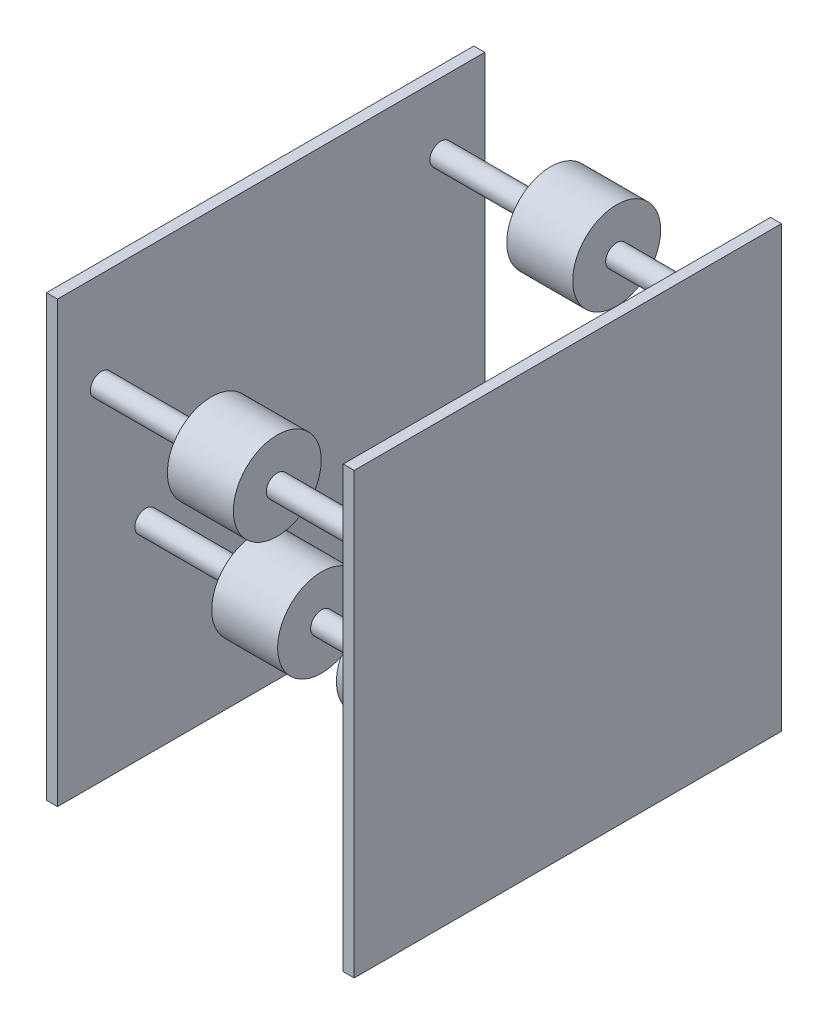
ISO-10303-21;
HEADER;
FILE_DESCRIPTION(('STEP AP214'),'2;1');
FILE_NAME('part.step','',(''),(''),'','','');
FILE_SCHEMA(('AUTOMOTIVE_DESIGN { 1 0 10303 214 1 1 1 1 }'));
ENDSEC;
DATA;
#1=APPLICATION_CONTEXT('core data for automotive mechanical design processes');
#2=APPLICATION_PROTOCOL_DEFINITION('international standard','automotive_design',2000,#1);
#3=PRODUCT_CONTEXT('',#1,'mechanical');
#4=PRODUCT('Part','Part','',(#3));
#5=PRODUCT_RELATED_PRODUCT_CATEGORY('part','',(#4));
#6=PRODUCT_DEFINITION_FORMATION('','',#4);
#7=PRODUCT_DEFINITION_CONTEXT('part definition',#1,'design');
#8=PRODUCT_DEFINITION('design','',#6,#7);
#9=PRODUCT_DEFINITION_SHAPE('','',#8);
#10=(LENGTH_UNIT() NAMED_UNIT(*) SI_UNIT(.MILLI.,.METRE.));
#11=(NAMED_UNIT(*) PLANE_ANGLE_UNIT() SI_UNIT($,.RADIAN.));
#12=(NAMED_UNIT(*) SI_UNIT($,.STERADIAN.) SOLID_ANGLE_UNIT());
#13=UNCERTAINTY_MEASURE_WITH_UNIT(LENGTH_MEASURE(1.E-05),#10,'distance_accuracy_value','');
#14=(GEOMETRIC_REPRESENTATION_CONTEXT(3) GLOBAL_UNCERTAINTY_ASSIGNED_CONTEXT((#13)) GLOBAL_UNIT_ASSIGNED_CONTEXT((#10,
#11,#12)) REPRESENTATION_CONTEXT('',''));
#15=CARTESIAN_POINT('',(0.,0.,0.));
#16=DIRECTION('',(0.,0.,1.));
#17=DIRECTION('',(1.,0.,0.));
#18=AXIS2_PLACEMENT_3D('',#15,#16,#17);
#19=CARTESIAN_POINT('',(100.510512242138,215.9,-221.50092631936));
#20=DIRECTION('',(-1.,0.,0.));
#21=DIRECTION('',(0.,0.,1.));
#22=AXIS2_PLACEMENT_3D('',#19,#20,#21);
#23=CYLINDRICAL_SURFACE('',#22,6.34999999999997);
#24=CARTESIAN_POINT('',(-82.55,215.9,-221.50092631936));
#25=DIRECTION('',(-1.,0.,0.));
#26=DIRECTION('',(0.,0.,1.));
#27=AXIS2_PLACEMENT_3D('',#24,#25,#26);
#28=CIRCLE('',#27,6.34999999999997);
#29=CARTESIAN_POINT('',(-82.55,215.9,-215.15092631936));
#30=VERTEX_POINT('',#29);
#31=EDGE_CURVE('E258',#30,#30,#28,.F.);
#32=ORIENTED_EDGE('',*,*,#31,.T.);
#33=EDGE_LOOP('',(#32));
#34=FACE_BOUND('',#33,.T.);
#35=CARTESIAN_POINT('',(-19.05,215.9,-221.50092631936));
#36=DIRECTION('',(1.,0.,0.));
#37=DIRECTION('',(0.,0.,-1.));
#38=AXIS2_PLACEMENT_3D('',#35,#36,#37);
#39=CIRCLE('',#38,6.34999999999997);
#40=CARTESIAN_POINT('',(-19.05,215.9,-227.85092631936));
#41=VERTEX_POINT('',#40);
#42=EDGE_CURVE('E11',#41,#41,#39,.T.);
#43=ORIENTED_EDGE('',*,*,#42,.F.);
#44=EDGE_LOOP('',(#43));
#45=FACE_BOUND('',#44,.T.);
#46=ADVANCED_FACE('F51',(#34,#45),#23,.T.);
#47=CARTESIAN_POINT('',(100.510512242138,198.743392040124,-25.4));
#48=DIRECTION('',(-1.,0.,0.));
#49=DIRECTION('',(0.,0.,1.));
#50=AXIS2_PLACEMENT_3D('',#47,#48,#49);
#51=CYLINDRICAL_SURFACE('',#50,6.35);
#52=CARTESIAN_POINT('',(-82.55,198.743392040124,-25.4));
#53=DIRECTION('',(-1.,0.,0.));
#54=DIRECTION('',(0.,0.,1.));
#55=AXIS2_PLACEMENT_3D('',#52,#53,#54);
#56=CIRCLE('',#55,6.35);
#57=CARTESIAN_POINT('',(-82.55,198.743392040124,-19.05));
#58=VERTEX_POINT('',#57);
#59=EDGE_CURVE('E240',#58,#58,#56,.F.);
#60=ORIENTED_EDGE('',*,*,#59,.T.);
#61=EDGE_LOOP('',(#60));
#62=FACE_BOUND('',#61,.T.);
#63=CARTESIAN_POINT('',(-19.05,198.743392040124,-25.4));
#64=DIRECTION('',(1.,0.,0.));
#65=DIRECTION('',(0.,0.,-1.));
#66=AXIS2_PLACEMENT_3D('',#63,#64,#65);
#67=CIRCLE('',#66,6.35);
#68=CARTESIAN_POINT('',(-19.05,198.743392040124,-31.75));
#69=VERTEX_POINT('',#68);
#70=EDGE_CURVE('E254',#69,#69,#67,.T.);
#71=ORIENTED_EDGE('',*,*,#70,.F.);
#72=EDGE_LOOP('',(#71));
#73=FACE_BOUND('',#72,.T.);
#74=ADVANCED_FACE('F310',(#62,#73),#51,.T.);
#75=CARTESIAN_POINT('',(100.510512242138,117.475000000001,-51.0238255843932));
#76=DIRECTION('',(-1.,0.,0.));
#77=DIRECTION('',(0.,0.,1.));
#78=AXIS2_PLACEMENT_3D('',#75,#76,#77);
#79=CYLINDRICAL_SURFACE('',#78,6.34999999999999);
#80=CARTESIAN_POINT('',(-82.55,117.475000000001,-51.0238255843932));
#81=DIRECTION('',(-1.,0.,0.));
#82=DIRECTION('',(0.,0.,1.));
#83=AXIS2_PLACEMENT_3D('',#80,#81,#82);
#84=CIRCLE('',#83,6.34999999999999);
#85=CARTESIAN_POINT('',(-82.55,117.475000000001,-44.6738255843932));
#86=VERTEX_POINT('',#85);
#87=EDGE_CURVE('E222',#86,#86,#84,.F.);
#88=ORIENTED_EDGE('',*,*,#87,.T.);
#89=EDGE_LOOP('',(#88));
#90=FACE_BOUND('',#89,.T.);
#91=CARTESIAN_POINT('',(-19.05,117.475000000001,-51.0238255843932));
#92=DIRECTION('',(1.,0.,0.));
#93=DIRECTION('',(0.,0.,-1.));
#94=AXIS2_PLACEMENT_3D('',#91,#92,#93);
#95=CIRCLE('',#94,6.34999999999999);
#96=CARTESIAN_POINT('',(-19.05,117.475000000001,-57.3738255843931));
#97=VERTEX_POINT('',#96);
#98=EDGE_CURVE('E236',#97,#97,#95,.T.);
#99=ORIENTED_EDGE('',*,*,#98,.F.);
#100=EDGE_LOOP('',(#99));
#101=FACE_BOUND('',#100,.T.);
#102=ADVANCED_FACE('F300',(#90,#101),#79,.T.);
#103=CARTESIAN_POINT('',(100.510512242138,45.4228992650335,-123.07592631936));
#104=DIRECTION('',(-1.,0.,0.));
#105=DIRECTION('',(0.,0.,1.));
#106=AXIS2_PLACEMENT_3D('',#103,#104,#105);
#107=CYLINDRICAL_SURFACE('',#106,6.35);
#108=CARTESIAN_POINT('',(-82.55,45.4228992650335,-123.07592631936));
#109=DIRECTION('',(-1.,0.,0.));
#110=DIRECTION('',(0.,0.,1.));
#111=AXIS2_PLACEMENT_3D('',#108,#109,#110);
#112=CIRCLE('',#111,6.35);
#113=CARTESIAN_POINT('',(-82.55,45.4228992650335,-116.72592631936));
#114=VERTEX_POINT('',#113);
#115=EDGE_CURVE('E206',#114,#114,#112,.F.);
#116=ORIENTED_EDGE('',*,*,#115,.T.);
#117=EDGE_LOOP('',(#116));
#118=FACE_BOUND('',#117,.T.);
#119=CARTESIAN_POINT('',(-19.05,45.4228992650335,-123.07592631936));
#120=DIRECTION('',(1.,0.,0.));
#121=DIRECTION('',(0.,0.,-1.));
#122=AXIS2_PLACEMENT_3D('',#119,#120,#121);
#123=CIRCLE('',#122,6.35);
#124=CARTESIAN_POINT('',(-19.05,45.4228992650335,-129.42592631936));
#125=VERTEX_POINT('',#124);
#126=EDGE_CURVE('E218',#125,#125,#123,.T.);
#127=ORIENTED_EDGE('',*,*,#126,.F.);
#128=EDGE_LOOP('',(#127));
#129=FACE_BOUND('',#128,.T.);
#130=ADVANCED_FACE('F289',(#118,#129),#107,.T.);
#131=CARTESIAN_POINT('',(100.510512242138,19.0500000000001,-221.50092631936));
#132=DIRECTION('',(-1.,0.,0.));
#133=DIRECTION('',(0.,0.,1.));
#134=AXIS2_PLACEMENT_3D('',#131,#132,#133);
#135=CYLINDRICAL_SURFACE('',#134,6.35);
#136=CARTESIAN_POINT('',(19.05,19.0500000000001,-221.50092631936));
#137=DIRECTION('',(1.,0.,0.));
#138=DIRECTION('',(0.,0.,-1.));
#139=AXIS2_PLACEMENT_3D('',#136,#137,#138);
#140=CIRCLE('',#139,6.35);
#141=CARTESIAN_POINT('',(19.05,19.0500000000001,-227.85092631936));
#142=VERTEX_POINT('',#141);
#143=EDGE_CURVE('E133',#142,#142,#140,.T.);
#144=ORIENTED_EDGE('',*,*,#143,.T.);
#145=EDGE_LOOP('',(#144));
#146=FACE_BOUND('',#145,.T.);
#147=CARTESIAN_POINT('',(82.55,19.0500000000001,-221.50092631936));
#148=DIRECTION('',(1.,0.,0.));
#149=DIRECTION('',(0.,0.,-1.));
#150=AXIS2_PLACEMENT_3D('',#147,#148,#149);
#151=CIRCLE('',#150,6.35);
#152=CARTESIAN_POINT('',(82.55,19.0500000000001,-227.85092631936));
#153=VERTEX_POINT('',#152);
#154=EDGE_CURVE('E154',#153,#153,#151,.T.);
#155=ORIENTED_EDGE('',*,*,#154,.F.);
#156=EDGE_LOOP('',(#155));
#157=FACE_BOUND('',#156,.T.);
#158=ADVANCED_FACE('F286',(#146,#157),#135,.T.);
#159=CARTESIAN_POINT('',(88.9,0.,0.));
#160=DIRECTION('',(-1.,0.,0.));
#161=DIRECTION('',(0.,0.,1.));
#162=AXIS2_PLACEMENT_3D('',#159,#160,#161);
#163=PLANE('',#162);
#164=DIRECTION('',(0.,-1.,0.));
#165=VECTOR('',#164,1.);
#166=CARTESIAN_POINT('',(88.9,0.,0.));
#167=LINE('',#166,#165);
#168=CARTESIAN_POINT('',(88.9,254.,0.));
#169=VERTEX_POINT('',#168);
#170=CARTESIAN_POINT('',(88.9,0.,0.));
#171=VERTEX_POINT('',#170);
#172=EDGE_CURVE('E379',#169,#171,#167,.T.);
#173=ORIENTED_EDGE('',*,*,#172,.T.);
#174=DIRECTION('',(0.,0.,-1.));
#175=VECTOR('',#174,1.);
#176=CARTESIAN_POINT('',(88.9,0.,0.));
#177=LINE('',#176,#175);
#178=CARTESIAN_POINT('',(88.9,0.,-246.90092631936));
#179=VERTEX_POINT('',#178);
#180=EDGE_CURVE('E146',#171,#179,#177,.T.);
#181=ORIENTED_EDGE('',*,*,#180,.T.);
#182=DIRECTION('',(0.,1.,0.));
#183=VECTOR('',#182,1.);
#184=CARTESIAN_POINT('',(88.9,0.,-246.90092631936));
#185=LINE('',#184,#183);
#186=CARTESIAN_POINT('',(88.9,254.,-246.90092631936));
#187=VERTEX_POINT('',#186);
#188=EDGE_CURVE('E385',#179,#187,#185,.T.);
#189=ORIENTED_EDGE('',*,*,#188,.T.);
#190=DIRECTION('',(0.,0.,1.));
#191=VECTOR('',#190,1.);
#192=CARTESIAN_POINT('',(88.9,254.,0.));
#193=LINE('',#192,#191);
#194=EDGE_CURVE('E388',#187,#169,#193,.T.);
#195=ORIENTED_EDGE('',*,*,#194,.T.);
#196=EDGE_LOOP('',(#173,#181,#189,#195));
#197=FACE_BOUND('',#196,.T.);
#198=ADVANCED_FACE('F288',(#197),#163,.F.);
#199=CARTESIAN_POINT('',(88.9,254.,0.));
#200=DIRECTION('',(0.,-1.,0.));
#201=DIRECTION('',(0.,0.,-1.));
#202=AXIS2_PLACEMENT_3D('',#199,#200,#201);
#203=PLANE('',#202);
#204=DIRECTION('',(-1.,0.,0.));
#205=VECTOR('',#204,1.);
#206=CARTESIAN_POINT('',(88.9,254.,-246.90092631936));
#207=LINE('',#206,#205);
#208=CARTESIAN_POINT('',(82.55,254.,-246.90092631936));
#209=VERTEX_POINT('',#208);
#210=EDGE_CURVE('E156',#187,#209,#207,.T.);
#211=ORIENTED_EDGE('',*,*,#210,.T.);
#212=DIRECTION('',(0.,0.,1.));
#213=VECTOR('',#212,1.);
#214=CARTESIAN_POINT('',(82.55,254.,0.));
#215=LINE('',#214,#213);
#216=CARTESIAN_POINT('',(82.55,254.,0.));
#217=VERTEX_POINT('',#216);
#218=EDGE_CURVE('E149',#209,#217,#215,.T.);
#219=ORIENTED_EDGE('',*,*,#218,.T.);
#220=DIRECTION('',(-1.,0.,0.));
#221=VECTOR('',#220,1.);
#222=CARTESIAN_POINT('',(88.9,254.,0.));
#223=LINE('',#222,#221);
#224=EDGE_CURVE('E142',#169,#217,#223,.T.);
#225=ORIENTED_EDGE('',*,*,#224,.F.);
#226=ORIENTED_EDGE('',*,*,#194,.F.);
#227=EDGE_LOOP('',(#211,#219,#225,#226));
#228=FACE_BOUND('',#227,.T.);
#229=ADVANCED_FACE('F297',(#228),#203,.F.);
#230=CARTESIAN_POINT('',(88.9,0.,-246.90092631936));
#231=DIRECTION('',(0.,0.,1.));
#232=DIRECTION('',(1.,0.,0.));
#233=AXIS2_PLACEMENT_3D('',#230,#231,#232);
#234=PLANE('',#233);
#235=DIRECTION('',(-1.,0.,0.));
#236=VECTOR('',#235,1.);
#237=CARTESIAN_POINT('',(88.9,0.,-246.90092631936));
#238=LINE('',#237,#236);
#239=CARTESIAN_POINT('',(82.55,0.,-246.90092631936));
#240=VERTEX_POINT('',#239);
#241=EDGE_CURVE('E150',#179,#240,#238,.T.);
#242=ORIENTED_EDGE('',*,*,#241,.T.);
#243=DIRECTION('',(0.,1.,0.));
#244=VECTOR('',#243,1.);
#245=CARTESIAN_POINT('',(82.55,0.,-246.90092631936));
#246=LINE('',#245,#244);
#247=EDGE_CURVE('E127',#240,#209,#246,.T.);
#248=ORIENTED_EDGE('',*,*,#247,.T.);
#249=ORIENTED_EDGE('',*,*,#210,.F.);
#250=ORIENTED_EDGE('',*,*,#188,.F.);
#251=EDGE_LOOP('',(#242,#248,#249,#250));
#252=FACE_BOUND('',#251,.T.);
#253=ADVANCED_FACE('F399',(#252),#234,.F.);
#254=CARTESIAN_POINT('',(88.9,0.,0.));
#255=DIRECTION('',(0.,1.,0.));
#256=DIRECTION('',(0.,0.,1.));
#257=AXIS2_PLACEMENT_3D('',#254,#255,#256);
#258=PLANE('',#257);
#259=DIRECTION('',(-1.,0.,0.));
#260=VECTOR('',#259,1.);
#261=CARTESIAN_POINT('',(88.9,0.,0.));
#262=LINE('',#261,#260);
#263=CARTESIAN_POINT('',(82.55,0.,0.));
#264=VERTEX_POINT('',#263);
#265=EDGE_CURVE('E140',#171,#264,#262,.T.);
#266=ORIENTED_EDGE('',*,*,#265,.T.);
#267=DIRECTION('',(0.,0.,-1.));
#268=VECTOR('',#267,1.);
#269=CARTESIAN_POINT('',(82.55,0.,0.));
#270=LINE('',#269,#268);
#271=EDGE_CURVE('E121',#264,#240,#270,.T.);
#272=ORIENTED_EDGE('',*,*,#271,.T.);
#273=ORIENTED_EDGE('',*,*,#241,.F.);
#274=ORIENTED_EDGE('',*,*,#180,.F.);
#275=EDGE_LOOP('',(#266,#272,#273,#274));
#276=FACE_BOUND('',#275,.T.);
#277=ADVANCED_FACE('F145',(#276),#258,.F.);
#278=CARTESIAN_POINT('',(88.9,0.,0.));
#279=DIRECTION('',(0.,0.,-1.));
#280=DIRECTION('',(-1.,0.,0.));
#281=AXIS2_PLACEMENT_3D('',#278,#279,#280);
#282=PLANE('',#281);
#283=ORIENTED_EDGE('',*,*,#224,.T.);
#284=DIRECTION('',(0.,1.,0.));
#285=VECTOR('',#284,1.);
#286=CARTESIAN_POINT('',(82.55,0.,0.));
#287=LINE('',#286,#285);
#288=EDGE_CURVE('E124',#264,#217,#287,.T.);
#289=ORIENTED_EDGE('',*,*,#288,.F.);
#290=ORIENTED_EDGE('',*,*,#265,.F.);
#291=ORIENTED_EDGE('',*,*,#172,.F.);
#292=EDGE_LOOP('',(#283,#289,#290,#291));
#293=FACE_BOUND('',#292,.T.);
#294=ADVANCED_FACE('F138',(#293),#282,.F.);
#295=CARTESIAN_POINT('',(82.55,0.,0.));
#296=DIRECTION('',(1.,0.,0.));
#297=DIRECTION('',(0.,0.,-1.));
#298=AXIS2_PLACEMENT_3D('',#295,#296,#297);
#299=PLANE('',#298);
#300=CARTESIAN_POINT('',(82.55,215.9,-221.50092631936));
#301=DIRECTION('',(1.,0.,0.));
#302=DIRECTION('',(0.,0.,-1.));
#303=AXIS2_PLACEMENT_3D('',#300,#301,#302);
#304=CIRCLE('',#303,6.34999999999997);
#305=CARTESIAN_POINT('',(82.55,215.9,-227.85092631936));
#306=VERTEX_POINT('',#305);
#307=EDGE_CURVE('E62',#306,#306,#304,.F.);
#308=ORIENTED_EDGE('',*,*,#307,.F.);
#309=EDGE_LOOP('',(#308));
#310=FACE_BOUND('',#309,.T.);
#311=CARTESIAN_POINT('',(82.55,198.743392040124,-25.4));
#312=DIRECTION('',(1.,0.,0.));
#313=DIRECTION('',(0.,0.,-1.));
#314=AXIS2_PLACEMENT_3D('',#311,#312,#313);
#315=CIRCLE('',#314,6.35);
#316=CARTESIAN_POINT('',(82.55,198.743392040124,-31.75));
#317=VERTEX_POINT('',#316);
#318=EDGE_CURVE('E250',#317,#317,#315,.F.);
#319=ORIENTED_EDGE('',*,*,#318,.F.);
#320=EDGE_LOOP('',(#319));
#321=FACE_BOUND('',#320,.T.);
#322=CARTESIAN_POINT('',(82.55,117.475000000001,-51.0238255843932));
#323=DIRECTION('',(1.,0.,0.));
#324=DIRECTION('',(0.,0.,-1.));
#325=AXIS2_PLACEMENT_3D('',#322,#323,#324);
#326=CIRCLE('',#325,6.34999999999999);
#327=CARTESIAN_POINT('',(82.55,117.475000000001,-57.3738255843931));
#328=VERTEX_POINT('',#327);
#329=EDGE_CURVE('E232',#328,#328,#326,.F.);
#330=ORIENTED_EDGE('',*,*,#329,.F.);
#331=EDGE_LOOP('',(#330));
#332=FACE_BOUND('',#331,.T.);
#333=CARTESIAN_POINT('',(82.55,45.4228992650335,-123.07592631936));
#334=DIRECTION('',(1.,0.,0.));
#335=DIRECTION('',(0.,0.,-1.));
#336=AXIS2_PLACEMENT_3D('',#333,#334,#335);
#337=CIRCLE('',#336,6.35);
#338=CARTESIAN_POINT('',(82.55,45.4228992650335,-129.42592631936));
#339=VERTEX_POINT('',#338);
#340=EDGE_CURVE('E214',#339,#339,#337,.F.);
#341=ORIENTED_EDGE('',*,*,#340,.F.);
#342=EDGE_LOOP('',(#341));
#343=FACE_BOUND('',#342,.T.);
#344=ORIENTED_EDGE('',*,*,#154,.T.);
#345=EDGE_LOOP('',(#344));
#346=FACE_BOUND('',#345,.T.);
#347=ORIENTED_EDGE('',*,*,#247,.F.);
#348=ORIENTED_EDGE('',*,*,#271,.F.);
#349=ORIENTED_EDGE('',*,*,#288,.T.);
#350=ORIENTED_EDGE('',*,*,#218,.F.);
#351=EDGE_LOOP('',(#347,#348,#349,#350));
#352=FACE_BOUND('',#351,.T.);
#353=ADVANCED_FACE('F123',(#310,#321,#332,#343,#346,#352),#299,.F.);
#354=CARTESIAN_POINT('',(19.05,19.0500000000001,-221.50092631936));
#355=DIRECTION('',(-1.,0.,0.));
#356=DIRECTION('',(0.,0.,1.));
#357=AXIS2_PLACEMENT_3D('',#354,#355,#356);
#358=CYLINDRICAL_SURFACE('',#357,25.4000000000002);
#359=CARTESIAN_POINT('',(19.05,19.0500000000001,-221.50092631936));
#360=DIRECTION('',(1.,0.,0.));
#361=DIRECTION('',(0.,0.,-1.));
#362=AXIS2_PLACEMENT_3D('',#359,#360,#361);
#363=CIRCLE('',#362,25.4000000000002);
#364=CARTESIAN_POINT('',(19.05,19.0500000000001,-246.90092631936));
#365=VERTEX_POINT('',#364);
#366=EDGE_CURVE('E227',#365,#365,#363,.T.);
#367=ORIENTED_EDGE('',*,*,#366,.F.);
#368=EDGE_LOOP('',(#367));
#369=FACE_BOUND('',#368,.T.);
#370=CARTESIAN_POINT('',(-19.05,19.0500000000001,-221.50092631936));
#371=DIRECTION('',(1.,0.,0.));
#372=DIRECTION('',(0.,0.,-1.));
#373=AXIS2_PLACEMENT_3D('',#370,#371,#372);
#374=CIRCLE('',#373,25.4000000000002);
#375=CARTESIAN_POINT('',(-19.05,19.0500000000001,-246.90092631936));
#376=VERTEX_POINT('',#375);
#377=EDGE_CURVE('E210',#376,#376,#374,.T.);
#378=ORIENTED_EDGE('',*,*,#377,.T.);
#379=EDGE_LOOP('',(#378));
#380=FACE_BOUND('',#379,.T.);
#381=ADVANCED_FACE('F276',(#369,#380),#358,.T.);
#382=CARTESIAN_POINT('',(19.05,19.0500000000001,-221.50092631936));
#383=DIRECTION('',(1.,0.,0.));
#384=DIRECTION('',(0.,0.,-1.));
#385=AXIS2_PLACEMENT_3D('',#382,#383,#384);
#386=PLANE('',#385);
#387=ORIENTED_EDGE('',*,*,#143,.F.);
#388=EDGE_LOOP('',(#387));
#389=FACE_BOUND('',#388,.T.);
#390=ORIENTED_EDGE('',*,*,#366,.T.);
#391=EDGE_LOOP('',(#390));
#392=FACE_BOUND('',#391,.T.);
#393=ADVANCED_FACE('F425',(#389,#392),#386,.T.);
#394=CARTESIAN_POINT('',(-19.05,19.0500000000001,-221.50092631936));
#395=DIRECTION('',(1.,0.,0.));
#396=DIRECTION('',(0.,0.,-1.));
#397=AXIS2_PLACEMENT_3D('',#394,#395,#396);
#398=PLANE('',#397);
#399=CARTESIAN_POINT('',(-19.05,19.0500000000001,-221.50092631936));
#400=DIRECTION('',(1.,0.,0.));
#401=DIRECTION('',(0.,0.,-1.));
#402=AXIS2_PLACEMENT_3D('',#399,#400,#401);
#403=CIRCLE('',#402,6.35);
#404=CARTESIAN_POINT('',(-19.05,19.0500000000001,-227.85092631936));
#405=VERTEX_POINT('',#404);
#406=EDGE_CURVE('E202',#405,#405,#403,.T.);
#407=ORIENTED_EDGE('',*,*,#406,.T.);
#408=EDGE_LOOP('',(#407));
#409=FACE_BOUND('',#408,.T.);
#410=ORIENTED_EDGE('',*,*,#377,.F.);
#411=EDGE_LOOP('',(#410));
#412=FACE_BOUND('',#411,.T.);
#413=ADVANCED_FACE('F439',(#409,#412),#398,.F.);
#414=CARTESIAN_POINT('',(-88.9,0.,0.));
#415=DIRECTION('',(-1.,0.,0.));
#416=DIRECTION('',(0.,0.,1.));
#417=AXIS2_PLACEMENT_3D('',#414,#415,#416);
#418=PLANE('',#417);
#419=DIRECTION('',(0.,-1.,0.));
#420=VECTOR('',#419,1.);
#421=CARTESIAN_POINT('',(-88.9,0.,0.));
#422=LINE('',#421,#420);
#423=CARTESIAN_POINT('',(-88.9,254.,0.));
#424=VERTEX_POINT('',#423);
#425=CARTESIAN_POINT('',(-88.9,0.,0.));
#426=VERTEX_POINT('',#425);
#427=EDGE_CURVE('E178',#424,#426,#422,.T.);
#428=ORIENTED_EDGE('',*,*,#427,.F.);
#429=DIRECTION('',(0.,0.,1.));
#430=VECTOR('',#429,1.);
#431=CARTESIAN_POINT('',(-88.9,254.,0.));
#432=LINE('',#431,#430);
#433=CARTESIAN_POINT('',(-88.9,254.,-246.90092631936));
#434=VERTEX_POINT('',#433);
#435=EDGE_CURVE('E166',#434,#424,#432,.T.);
#436=ORIENTED_EDGE('',*,*,#435,.F.);
#437=DIRECTION('',(0.,1.,0.));
#438=VECTOR('',#437,1.);
#439=CARTESIAN_POINT('',(-88.9,0.,-246.90092631936));
#440=LINE('',#439,#438);
#441=CARTESIAN_POINT('',(-88.9,0.,-246.90092631936));
#442=VERTEX_POINT('',#441);
#443=EDGE_CURVE('E165',#442,#434,#440,.T.);
#444=ORIENTED_EDGE('',*,*,#443,.F.);
#445=DIRECTION('',(0.,0.,-1.));
#446=VECTOR('',#445,1.);
#447=CARTESIAN_POINT('',(-88.9,0.,0.));
#448=LINE('',#447,#446);
#449=EDGE_CURVE('E173',#426,#442,#448,.T.);
#450=ORIENTED_EDGE('',*,*,#449,.F.);
#451=EDGE_LOOP('',(#428,#436,#444,#450));
#452=FACE_BOUND('',#451,.T.);
#453=ADVANCED_FACE('F452',(#452),#418,.T.);
#454=CARTESIAN_POINT('',(88.9,254.,0.));
#455=DIRECTION('',(0.,-1.,0.));
#456=DIRECTION('',(0.,0.,-1.));
#457=AXIS2_PLACEMENT_3D('',#454,#455,#456);
#458=PLANE('',#457);
#459=DIRECTION('',(-1.,0.,0.));
#460=VECTOR('',#459,1.);
#461=CARTESIAN_POINT('',(88.9,254.,0.));
#462=LINE('',#461,#460);
#463=CARTESIAN_POINT('',(-82.55,254.,0.));
#464=VERTEX_POINT('',#463);
#465=EDGE_CURVE('E182',#464,#424,#462,.T.);
#466=ORIENTED_EDGE('',*,*,#465,.F.);
#467=DIRECTION('',(0.,0.,-1.));
#468=VECTOR('',#467,1.);
#469=CARTESIAN_POINT('',(-82.55,254.,0.));
#470=LINE('',#469,#468);
#471=CARTESIAN_POINT('',(-82.55,254.,-246.90092631936));
#472=VERTEX_POINT('',#471);
#473=EDGE_CURVE('E70',#464,#472,#470,.T.);
#474=ORIENTED_EDGE('',*,*,#473,.T.);
#475=DIRECTION('',(-1.,0.,0.));
#476=VECTOR('',#475,1.);
#477=CARTESIAN_POINT('',(88.9,254.,-246.90092631936));
#478=LINE('',#477,#476);
#479=EDGE_CURVE('E89',#472,#434,#478,.T.);
#480=ORIENTED_EDGE('',*,*,#479,.T.);
#481=ORIENTED_EDGE('',*,*,#435,.T.);
#482=EDGE_LOOP('',(#466,#474,#480,#481));
#483=FACE_BOUND('',#482,.T.);
#484=ADVANCED_FACE('F746',(#483),#458,.F.);
#485=CARTESIAN_POINT('',(88.9,0.,-246.90092631936));
#486=DIRECTION('',(0.,0.,1.));
#487=DIRECTION('',(1.,0.,0.));
#488=AXIS2_PLACEMENT_3D('',#485,#486,#487);
#489=PLANE('',#488);
#490=ORIENTED_EDGE('',*,*,#479,.F.);
#491=DIRECTION('',(0.,1.,0.));
#492=VECTOR('',#491,1.);
#493=CARTESIAN_POINT('',(-82.55,0.,-246.90092631936));
#494=LINE('',#493,#492);
#495=CARTESIAN_POINT('',(-82.55,0.,-246.90092631936));
#496=VERTEX_POINT('',#495);
#497=EDGE_CURVE('E169',#496,#472,#494,.T.);
#498=ORIENTED_EDGE('',*,*,#497,.F.);
#499=DIRECTION('',(-1.,0.,0.));
#500=VECTOR('',#499,1.);
#501=CARTESIAN_POINT('',(88.9,0.,-246.90092631936));
#502=LINE('',#501,#500);
#503=EDGE_CURVE('E172',#496,#442,#502,.T.);
#504=ORIENTED_EDGE('',*,*,#503,.T.);
#505=ORIENTED_EDGE('',*,*,#443,.T.);
#506=EDGE_LOOP('',(#490,#498,#504,#505));
#507=FACE_BOUND('',#506,.T.);
#508=ADVANCED_FACE('F754',(#507),#489,.F.);
#509=CARTESIAN_POINT('',(88.9,0.,0.));
#510=DIRECTION('',(0.,1.,0.));
#511=DIRECTION('',(0.,0.,1.));
#512=AXIS2_PLACEMENT_3D('',#509,#510,#511);
#513=PLANE('',#512);
#514=ORIENTED_EDGE('',*,*,#503,.F.);
#515=DIRECTION('',(0.,0.,1.));
#516=VECTOR('',#515,1.);
#517=CARTESIAN_POINT('',(-82.55,0.,0.));
#518=LINE('',#517,#516);
#519=CARTESIAN_POINT('',(-82.55,0.,0.));
#520=VERTEX_POINT('',#519);
#521=EDGE_CURVE('E79',#496,#520,#518,.T.);
#522=ORIENTED_EDGE('',*,*,#521,.T.);
#523=DIRECTION('',(-1.,0.,0.));
#524=VECTOR('',#523,1.);
#525=CARTESIAN_POINT('',(88.9,0.,0.));
#526=LINE('',#525,#524);
#527=EDGE_CURVE('E177',#520,#426,#526,.T.);
#528=ORIENTED_EDGE('',*,*,#527,.T.);
#529=ORIENTED_EDGE('',*,*,#449,.T.);
#530=EDGE_LOOP('',(#514,#522,#528,#529));
#531=FACE_BOUND('',#530,.T.);
#532=ADVANCED_FACE('F763',(#531),#513,.F.);
#533=CARTESIAN_POINT('',(88.9,0.,0.));
#534=DIRECTION('',(0.,0.,-1.));
#535=DIRECTION('',(-1.,0.,0.));
#536=AXIS2_PLACEMENT_3D('',#533,#534,#535);
#537=PLANE('',#536);
#538=ORIENTED_EDGE('',*,*,#527,.F.);
#539=DIRECTION('',(0.,1.,0.));
#540=VECTOR('',#539,1.);
#541=CARTESIAN_POINT('',(-82.55,0.,0.));
#542=LINE('',#541,#540);
#543=EDGE_CURVE('E82',#520,#464,#542,.T.);
#544=ORIENTED_EDGE('',*,*,#543,.T.);
#545=ORIENTED_EDGE('',*,*,#465,.T.);
#546=ORIENTED_EDGE('',*,*,#427,.T.);
#547=EDGE_LOOP('',(#538,#544,#545,#546));
#548=FACE_BOUND('',#547,.T.);
#549=ADVANCED_FACE('F53',(#548),#537,.F.);
#550=CARTESIAN_POINT('',(-82.55,0.,0.));
#551=DIRECTION('',(-1.,0.,0.));
#552=DIRECTION('',(0.,0.,1.));
#553=AXIS2_PLACEMENT_3D('',#550,#551,#552);
#554=PLANE('',#553);
#555=ORIENTED_EDGE('',*,*,#31,.F.);
#556=EDGE_LOOP('',(#555));
#557=FACE_BOUND('',#556,.T.);
#558=ORIENTED_EDGE('',*,*,#59,.F.);
#559=EDGE_LOOP('',(#558));
#560=FACE_BOUND('',#559,.T.);
#561=ORIENTED_EDGE('',*,*,#87,.F.);
#562=EDGE_LOOP('',(#561));
#563=FACE_BOUND('',#562,.T.);
#564=ORIENTED_EDGE('',*,*,#115,.F.);
#565=EDGE_LOOP('',(#564));
#566=FACE_BOUND('',#565,.T.);
#567=CARTESIAN_POINT('',(-82.55,19.0500000000001,-221.50092631936));
#568=DIRECTION('',(-1.,0.,0.));
#569=DIRECTION('',(0.,0.,1.));
#570=AXIS2_PLACEMENT_3D('',#567,#568,#569);
#571=CIRCLE('',#570,6.35);
#572=CARTESIAN_POINT('',(-82.55,19.0500000000001,-215.15092631936));
#573=VERTEX_POINT('',#572);
#574=EDGE_CURVE('E187',#573,#573,#571,.F.);
#575=ORIENTED_EDGE('',*,*,#574,.F.);
#576=EDGE_LOOP('',(#575));
#577=FACE_BOUND('',#576,.T.);
#578=ORIENTED_EDGE('',*,*,#543,.F.);
#579=ORIENTED_EDGE('',*,*,#521,.F.);
#580=ORIENTED_EDGE('',*,*,#497,.T.);
#581=ORIENTED_EDGE('',*,*,#473,.F.);
#582=EDGE_LOOP('',(#578,#579,#580,#581));
#583=FACE_BOUND('',#582,.T.);
#584=ADVANCED_FACE('F307',(#557,#560,#563,#566,#577,#583),#554,.F.);
#585=ORIENTED_EDGE('',*,*,#574,.T.);
#586=EDGE_LOOP('',(#585));
#587=FACE_BOUND('',#586,.T.);
#588=ORIENTED_EDGE('',*,*,#406,.F.);
#589=EDGE_LOOP('',(#588));
#590=FACE_BOUND('',#589,.T.);
#591=ADVANCED_FACE('F292',(#587,#590),#135,.T.);
#592=CARTESIAN_POINT('',(19.05,45.4228992650335,-123.07592631936));
#593=DIRECTION('',(1.,0.,0.));
#594=DIRECTION('',(0.,0.,-1.));
#595=AXIS2_PLACEMENT_3D('',#592,#593,#594);
#596=CIRCLE('',#595,6.35);
#597=CARTESIAN_POINT('',(19.05,45.4228992650335,-129.42592631936));
#598=VERTEX_POINT('',#597);
#599=EDGE_CURVE('E223',#598,#598,#596,.T.);
#600=ORIENTED_EDGE('',*,*,#599,.T.);
#601=EDGE_LOOP('',(#600));
#602=FACE_BOUND('',#601,.T.);
#603=ORIENTED_EDGE('',*,*,#340,.T.);
#604=EDGE_LOOP('',(#603));
#605=FACE_BOUND('',#604,.T.);
#606=ADVANCED_FACE('F303',(#602,#605),#107,.T.);
#607=CARTESIAN_POINT('',(19.05,45.4228992650335,-123.07592631936));
#608=DIRECTION('',(-1.,0.,0.));
#609=DIRECTION('',(0.,0.,1.));
#610=AXIS2_PLACEMENT_3D('',#607,#608,#609);
#611=CYLINDRICAL_SURFACE('',#610,25.4000000000001);
#612=CARTESIAN_POINT('',(19.05,45.4228992650335,-123.07592631936));
#613=DIRECTION('',(1.,0.,0.));
#614=DIRECTION('',(0.,0.,-1.));
#615=AXIS2_PLACEMENT_3D('',#612,#613,#614);
#616=CIRCLE('',#615,25.4000000000001);
#617=CARTESIAN_POINT('',(19.05,45.4228992650335,-148.47592631936));
#618=VERTEX_POINT('',#617);
#619=EDGE_CURVE('E245',#618,#618,#616,.T.);
#620=ORIENTED_EDGE('',*,*,#619,.F.);
#621=EDGE_LOOP('',(#620));
#622=FACE_BOUND('',#621,.T.);
#623=CARTESIAN_POINT('',(-19.05,45.4228992650335,-123.07592631936));
#624=DIRECTION('',(1.,0.,0.));
#625=DIRECTION('',(0.,0.,-1.));
#626=AXIS2_PLACEMENT_3D('',#623,#624,#625);
#627=CIRCLE('',#626,25.4000000000001);
#628=CARTESIAN_POINT('',(-19.05,45.4228992650335,-148.47592631936));
#629=VERTEX_POINT('',#628);
#630=EDGE_CURVE('E228',#629,#629,#627,.T.);
#631=ORIENTED_EDGE('',*,*,#630,.T.);
#632=EDGE_LOOP('',(#631));
#633=FACE_BOUND('',#632,.T.);
#634=ADVANCED_FACE('F480',(#622,#633),#611,.T.);
#635=CARTESIAN_POINT('',(19.05,45.4228992650335,-123.07592631936));
#636=DIRECTION('',(1.,0.,0.));
#637=DIRECTION('',(0.,0.,-1.));
#638=AXIS2_PLACEMENT_3D('',#635,#636,#637);
#639=PLANE('',#638);
#640=ORIENTED_EDGE('',*,*,#599,.F.);
#641=EDGE_LOOP('',(#640));
#642=FACE_BOUND('',#641,.T.);
#643=ORIENTED_EDGE('',*,*,#619,.T.);
#644=EDGE_LOOP('',(#643));
#645=FACE_BOUND('',#644,.T.);
#646=ADVANCED_FACE('F489',(#642,#645),#639,.T.);
#647=CARTESIAN_POINT('',(-19.05,45.4228992650335,-123.07592631936));
#648=DIRECTION('',(1.,0.,0.));
#649=DIRECTION('',(0.,0.,-1.));
#650=AXIS2_PLACEMENT_3D('',#647,#648,#649);
#651=PLANE('',#650);
#652=ORIENTED_EDGE('',*,*,#126,.T.);
#653=EDGE_LOOP('',(#652));
#654=FACE_BOUND('',#653,.T.);
#655=ORIENTED_EDGE('',*,*,#630,.F.);
#656=EDGE_LOOP('',(#655));
#657=FACE_BOUND('',#656,.T.);
#658=ADVANCED_FACE('F502',(#654,#657),#651,.F.);
#659=CARTESIAN_POINT('',(19.05,117.475000000001,-51.0238255843932));
#660=DIRECTION('',(1.,0.,0.));
#661=DIRECTION('',(0.,0.,-1.));
#662=AXIS2_PLACEMENT_3D('',#659,#660,#661);
#663=CIRCLE('',#662,6.34999999999999);
#664=CARTESIAN_POINT('',(19.05,117.475000000001,-57.3738255843931));
#665=VERTEX_POINT('',#664);
#666=EDGE_CURVE('E241',#665,#665,#663,.T.);
#667=ORIENTED_EDGE('',*,*,#666,.T.);
#668=EDGE_LOOP('',(#667));
#669=FACE_BOUND('',#668,.T.);
#670=ORIENTED_EDGE('',*,*,#329,.T.);
#671=EDGE_LOOP('',(#670));
#672=FACE_BOUND('',#671,.T.);
#673=ADVANCED_FACE('F515',(#669,#672),#79,.T.);
#674=CARTESIAN_POINT('',(19.05,117.475000000001,-51.0238255843932));
#675=DIRECTION('',(-1.,0.,0.));
#676=DIRECTION('',(0.,0.,1.));
#677=AXIS2_PLACEMENT_3D('',#674,#675,#676);
#678=CYLINDRICAL_SURFACE('',#677,25.4);
#679=CARTESIAN_POINT('',(19.05,117.475000000001,-51.0238255843932));
#680=DIRECTION('',(1.,0.,0.));
#681=DIRECTION('',(0.,0.,-1.));
#682=AXIS2_PLACEMENT_3D('',#679,#680,#681);
#683=CIRCLE('',#682,25.4);
#684=CARTESIAN_POINT('',(19.05,117.475000000001,-76.4238255843932));
#685=VERTEX_POINT('',#684);
#686=EDGE_CURVE('E263',#685,#685,#683,.T.);
#687=ORIENTED_EDGE('',*,*,#686,.F.);
#688=EDGE_LOOP('',(#687));
#689=FACE_BOUND('',#688,.T.);
#690=CARTESIAN_POINT('',(-19.05,117.475000000001,-51.0238255843932));
#691=DIRECTION('',(1.,0.,0.));
#692=DIRECTION('',(0.,0.,-1.));
#693=AXIS2_PLACEMENT_3D('',#690,#691,#692);
#694=CIRCLE('',#693,25.4);
#695=CARTESIAN_POINT('',(-19.05,117.475000000001,-76.4238255843932));
#696=VERTEX_POINT('',#695);
#697=EDGE_CURVE('E246',#696,#696,#694,.T.);
#698=ORIENTED_EDGE('',*,*,#697,.T.);
#699=EDGE_LOOP('',(#698));
#700=FACE_BOUND('',#699,.T.);
#701=ADVANCED_FACE('F526',(#689,#700),#678,.T.);
#702=CARTESIAN_POINT('',(19.05,117.475000000001,-51.0238255843932));
#703=DIRECTION('',(1.,0.,0.));
#704=DIRECTION('',(0.,0.,-1.));
#705=AXIS2_PLACEMENT_3D('',#702,#703,#704);
#706=PLANE('',#705);
#707=ORIENTED_EDGE('',*,*,#666,.F.);
#708=EDGE_LOOP('',(#707));
#709=FACE_BOUND('',#708,.T.);
#710=ORIENTED_EDGE('',*,*,#686,.T.);
#711=EDGE_LOOP('',(#710));
#712=FACE_BOUND('',#711,.T.);
#713=ADVANCED_FACE('F537',(#709,#712),#706,.T.);
#714=CARTESIAN_POINT('',(-19.05,117.475000000001,-51.0238255843932));
#715=DIRECTION('',(1.,0.,0.));
#716=DIRECTION('',(0.,0.,-1.));
#717=AXIS2_PLACEMENT_3D('',#714,#715,#716);
#718=PLANE('',#717);
#719=ORIENTED_EDGE('',*,*,#98,.T.);
#720=EDGE_LOOP('',(#719));
#721=FACE_BOUND('',#720,.T.);
#722=ORIENTED_EDGE('',*,*,#697,.F.);
#723=EDGE_LOOP('',(#722));
#724=FACE_BOUND('',#723,.T.);
#725=ADVANCED_FACE('F550',(#721,#724),#718,.F.);
#726=CARTESIAN_POINT('',(19.05,198.743392040124,-25.4));
#727=DIRECTION('',(1.,0.,0.));
#728=DIRECTION('',(0.,0.,-1.));
#729=AXIS2_PLACEMENT_3D('',#726,#727,#728);
#730=CIRCLE('',#729,6.35);
#731=CARTESIAN_POINT('',(19.05,198.743392040124,-31.75));
#732=VERTEX_POINT('',#731);
#733=EDGE_CURVE('E259',#732,#732,#730,.T.);
#734=ORIENTED_EDGE('',*,*,#733,.T.);
#735=EDGE_LOOP('',(#734));
#736=FACE_BOUND('',#735,.T.);
#737=ORIENTED_EDGE('',*,*,#318,.T.);
#738=EDGE_LOOP('',(#737));
#739=FACE_BOUND('',#738,.T.);
#740=ADVANCED_FACE('F319',(#736,#739),#51,.T.);
#741=CARTESIAN_POINT('',(19.05,198.743392040124,-25.4));
#742=DIRECTION('',(-1.,0.,0.));
#743=DIRECTION('',(0.,0.,1.));
#744=AXIS2_PLACEMENT_3D('',#741,#742,#743);
#745=CYLINDRICAL_SURFACE('',#744,25.4);
#746=CARTESIAN_POINT('',(19.05,198.743392040124,-25.4));
#747=DIRECTION('',(1.,0.,0.));
#748=DIRECTION('',(0.,0.,-1.));
#749=AXIS2_PLACEMENT_3D('',#746,#747,#748);
#750=CIRCLE('',#749,25.4);
#751=CARTESIAN_POINT('',(19.05,198.743392040124,-50.8));
#752=VERTEX_POINT('',#751);
#753=EDGE_CURVE('E342',#752,#752,#750,.T.);
#754=ORIENTED_EDGE('',*,*,#753,.F.);
#755=EDGE_LOOP('',(#754));
#756=FACE_BOUND('',#755,.T.);
#757=CARTESIAN_POINT('',(-19.05,198.743392040124,-25.4));
#758=DIRECTION('',(1.,0.,0.));
#759=DIRECTION('',(0.,0.,-1.));
#760=AXIS2_PLACEMENT_3D('',#757,#758,#759);
#761=CIRCLE('',#760,25.4);
#762=CARTESIAN_POINT('',(-19.05,198.743392040124,-50.8));
#763=VERTEX_POINT('',#762);
#764=EDGE_CURVE('E264',#763,#763,#761,.T.);
#765=ORIENTED_EDGE('',*,*,#764,.T.);
#766=EDGE_LOOP('',(#765));
#767=FACE_BOUND('',#766,.T.);
#768=ADVANCED_FACE('F570',(#756,#767),#745,.T.);
#769=CARTESIAN_POINT('',(19.05,198.743392040124,-25.4));
#770=DIRECTION('',(1.,0.,0.));
#771=DIRECTION('',(0.,0.,-1.));
#772=AXIS2_PLACEMENT_3D('',#769,#770,#771);
#773=PLANE('',#772);
#774=ORIENTED_EDGE('',*,*,#733,.F.);
#775=EDGE_LOOP('',(#774));
#776=FACE_BOUND('',#775,.T.);
#777=ORIENTED_EDGE('',*,*,#753,.T.);
#778=EDGE_LOOP('',(#777));
#779=FACE_BOUND('',#778,.T.);
#780=ADVANCED_FACE('F335',(#776,#779),#773,.T.);
#781=CARTESIAN_POINT('',(-19.05,198.743392040124,-25.4));
#782=DIRECTION('',(1.,0.,0.));
#783=DIRECTION('',(0.,0.,-1.));
#784=AXIS2_PLACEMENT_3D('',#781,#782,#783);
#785=PLANE('',#784);
#786=ORIENTED_EDGE('',*,*,#70,.T.);
#787=EDGE_LOOP('',(#786));
#788=FACE_BOUND('',#787,.T.);
#789=ORIENTED_EDGE('',*,*,#764,.F.);
#790=EDGE_LOOP('',(#789));
#791=FACE_BOUND('',#790,.T.);
#792=ADVANCED_FACE('F325',(#788,#791),#785,.F.);
#793=CARTESIAN_POINT('',(19.05,215.9,-221.50092631936));
#794=DIRECTION('',(1.,0.,0.));
#795=DIRECTION('',(0.,0.,-1.));
#796=AXIS2_PLACEMENT_3D('',#793,#794,#795);
#797=CIRCLE('',#796,6.34999999999997);
#798=CARTESIAN_POINT('',(19.05,215.9,-227.85092631936));
#799=VERTEX_POINT('',#798);
#800=EDGE_CURVE('E55',#799,#799,#797,.T.);
#801=ORIENTED_EDGE('',*,*,#800,.T.);
#802=EDGE_LOOP('',(#801));
#803=FACE_BOUND('',#802,.T.);
#804=ORIENTED_EDGE('',*,*,#307,.T.);
#805=EDGE_LOOP('',(#804));
#806=FACE_BOUND('',#805,.T.);
#807=ADVANCED_FACE('F272',(#803,#806),#23,.T.);
#808=CARTESIAN_POINT('',(19.05,215.9,-221.50092631936));
#809=DIRECTION('',(-1.,0.,0.));
#810=DIRECTION('',(0.,0.,1.));
#811=AXIS2_PLACEMENT_3D('',#808,#809,#810);
#812=CYLINDRICAL_SURFACE('',#811,25.4);
#813=CARTESIAN_POINT('',(19.05,215.9,-221.50092631936));
#814=DIRECTION('',(1.,0.,0.));
#815=DIRECTION('',(0.,0.,-1.));
#816=AXIS2_PLACEMENT_3D('',#813,#814,#815);
#817=CIRCLE('',#816,25.4);
#818=CARTESIAN_POINT('',(19.05,215.9,-246.90092631936));
#819=VERTEX_POINT('',#818);
#820=EDGE_CURVE('E343',#819,#819,#817,.T.);
#821=ORIENTED_EDGE('',*,*,#820,.F.);
#822=EDGE_LOOP('',(#821));
#823=FACE_BOUND('',#822,.T.);
#824=CARTESIAN_POINT('',(-19.05,215.9,-221.50092631936));
#825=DIRECTION('',(1.,0.,0.));
#826=DIRECTION('',(0.,0.,-1.));
#827=AXIS2_PLACEMENT_3D('',#824,#825,#826);
#828=CIRCLE('',#827,25.4);
#829=CARTESIAN_POINT('',(-19.05,215.9,-246.90092631936));
#830=VERTEX_POINT('',#829);
#831=EDGE_CURVE('E349',#830,#830,#828,.T.);
#832=ORIENTED_EDGE('',*,*,#831,.T.);
#833=EDGE_LOOP('',(#832));
#834=FACE_BOUND('',#833,.T.);
#835=ADVANCED_FACE('F324',(#823,#834),#812,.T.);
#836=CARTESIAN_POINT('',(19.05,215.9,-221.50092631936));
#837=DIRECTION('',(1.,0.,0.));
#838=DIRECTION('',(0.,0.,-1.));
#839=AXIS2_PLACEMENT_3D('',#836,#837,#838);
#840=PLANE('',#839);
#841=ORIENTED_EDGE('',*,*,#800,.F.);
#842=EDGE_LOOP('',(#841));
#843=FACE_BOUND('',#842,.T.);
#844=ORIENTED_EDGE('',*,*,#820,.T.);
#845=EDGE_LOOP('',(#844));
#846=FACE_BOUND('',#845,.T.);
#847=ADVANCED_FACE('F332',(#843,#846),#840,.T.);
#848=CARTESIAN_POINT('',(-19.05,215.9,-221.50092631936));
#849=DIRECTION('',(1.,0.,0.));
#850=DIRECTION('',(0.,0.,-1.));
#851=AXIS2_PLACEMENT_3D('',#848,#849,#850);
#852=PLANE('',#851);
#853=ORIENTED_EDGE('',*,*,#42,.T.);
#854=EDGE_LOOP('',(#853));
#855=FACE_BOUND('',#854,.T.);
#856=ORIENTED_EDGE('',*,*,#831,.F.);
#857=EDGE_LOOP('',(#856));
#858=FACE_BOUND('',#857,.T.);
#859=ADVANCED_FACE('F610',(#855,#858),#852,.F.);
#860=CLOSED_SHELL('',(#46,#74,#102,#130,#158,#198,#229,#253,#277,#294,#353,#381,#393,#413,#453,
#484,#508,#532,#549,#584,#591,#606,#634,#646,#658,#673,#701,#713,#725,#740,#768,#780,#792,#807,
#835,#847,#859));
#861=MANIFOLD_SOLID_BREP('B2',#860);
#862=ADVANCED_BREP_SHAPE_REPRESENTATION('',(#18,#861),#14);
#863=SHAPE_DEFINITION_REPRESENTATION(#9,#862);
ENDSEC;
END-ISO-10303-21;
